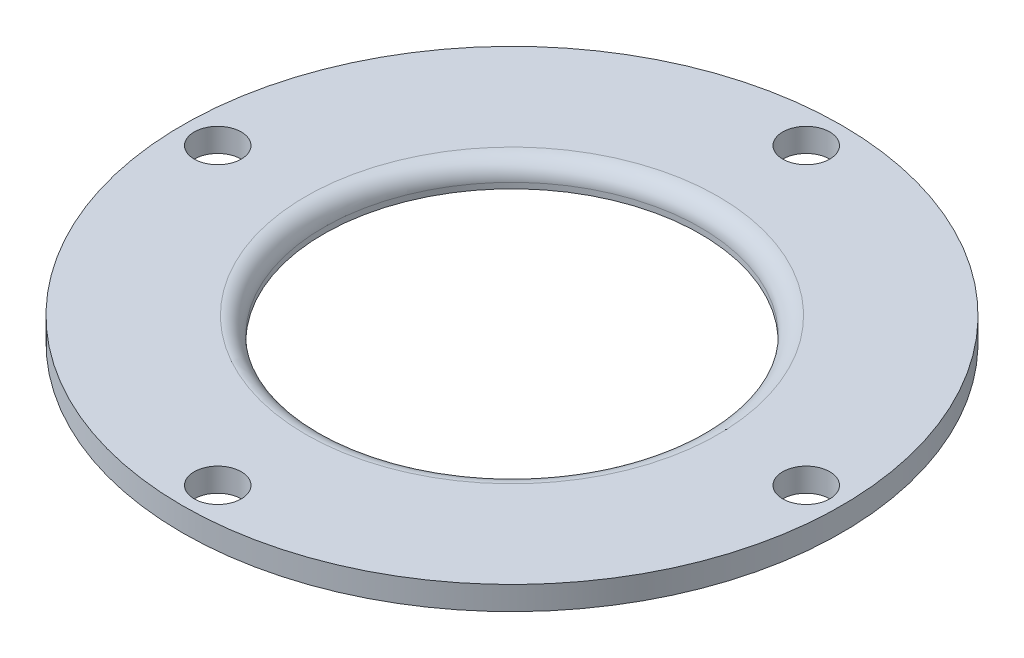
ISO-10303-21;
HEADER;
FILE_DESCRIPTION(('STEP AP214'),'2;1');
FILE_NAME('part.step','',(''),(''),'','','');
FILE_SCHEMA(('AUTOMOTIVE_DESIGN { 1 0 10303 214 1 1 1 1 }'));
ENDSEC;
DATA;
#1=APPLICATION_CONTEXT('core data for automotive mechanical design processes');
#2=APPLICATION_PROTOCOL_DEFINITION('international standard','automotive_design',2000,#1);
#3=PRODUCT_CONTEXT('',#1,'mechanical');
#4=PRODUCT('Part','Part','',(#3));
#5=PRODUCT_RELATED_PRODUCT_CATEGORY('part','',(#4));
#6=PRODUCT_DEFINITION_FORMATION('','',#4);
#7=PRODUCT_DEFINITION_CONTEXT('part definition',#1,'design');
#8=PRODUCT_DEFINITION('design','',#6,#7);
#9=PRODUCT_DEFINITION_SHAPE('','',#8);
#10=(LENGTH_UNIT() NAMED_UNIT(*) SI_UNIT(.MILLI.,.METRE.));
#11=(NAMED_UNIT(*) PLANE_ANGLE_UNIT() SI_UNIT($,.RADIAN.));
#12=(NAMED_UNIT(*) SI_UNIT($,.STERADIAN.) SOLID_ANGLE_UNIT());
#13=UNCERTAINTY_MEASURE_WITH_UNIT(LENGTH_MEASURE(1.E-05),#10,'distance_accuracy_value','');
#14=(GEOMETRIC_REPRESENTATION_CONTEXT(3) GLOBAL_UNCERTAINTY_ASSIGNED_CONTEXT((#13)) GLOBAL_UNIT_ASSIGNED_CONTEXT((#10,
#11,#12)) REPRESENTATION_CONTEXT('',''));
#15=CARTESIAN_POINT('',(0.,0.,0.));
#16=DIRECTION('',(0.,0.,1.));
#17=DIRECTION('',(1.,0.,0.));
#18=AXIS2_PLACEMENT_3D('',#15,#16,#17);
#19=CARTESIAN_POINT('',(0.,6.35,0.));
#20=DIRECTION('',(0.,-1.,0.));
#21=DIRECTION('',(0.,0.,-1.));
#22=AXIS2_PLACEMENT_3D('',#19,#20,#21);
#23=CYLINDRICAL_SURFACE('',#22,88.9);
#24=CARTESIAN_POINT('',(0.,6.35,0.));
#25=DIRECTION('',(0.,1.,0.));
#26=DIRECTION('',(0.,0.,1.));
#27=AXIS2_PLACEMENT_3D('',#24,#25,#26);
#28=CIRCLE('',#27,88.9);
#29=CARTESIAN_POINT('',(0.,6.35,88.9));
#30=VERTEX_POINT('',#29);
#31=EDGE_CURVE('E41',#30,#30,#28,.T.);
#32=ORIENTED_EDGE('',*,*,#31,.F.);
#33=EDGE_LOOP('',(#32));
#34=FACE_BOUND('',#33,.T.);
#35=CARTESIAN_POINT('',(0.,0.,0.));
#36=DIRECTION('',(0.,1.,0.));
#37=DIRECTION('',(0.,0.,1.));
#38=AXIS2_PLACEMENT_3D('',#35,#36,#37);
#39=CIRCLE('',#38,88.9);
#40=CARTESIAN_POINT('',(0.,0.,88.9));
#41=VERTEX_POINT('',#40);
#42=EDGE_CURVE('E45',#41,#41,#39,.T.);
#43=ORIENTED_EDGE('',*,*,#42,.T.);
#44=EDGE_LOOP('',(#43));
#45=FACE_BOUND('',#44,.T.);
#46=ADVANCED_FACE('F30',(#34,#45),#23,.T.);
#47=CARTESIAN_POINT('',(0.,6.35,0.));
#48=DIRECTION('',(0.,1.,0.));
#49=DIRECTION('',(0.,0.,1.));
#50=AXIS2_PLACEMENT_3D('',#47,#48,#49);
#51=PLANE('',#50);
#52=CARTESIAN_POINT('',(-2.77136331270674E-13,6.35,-79.375));
#53=DIRECTION('',(0.,-1.,0.));
#54=DIRECTION('',(0.,0.,-1.));
#55=AXIS2_PLACEMENT_3D('',#52,#53,#54);
#56=CIRCLE('',#55,6.34999999999999);
#57=CARTESIAN_POINT('',(-2.77136331270674E-13,6.35,-85.725));
#58=VERTEX_POINT('',#57);
#59=EDGE_CURVE('E53',#58,#58,#56,.T.);
#60=ORIENTED_EDGE('',*,*,#59,.T.);
#61=EDGE_LOOP('',(#60));
#62=FACE_BOUND('',#61,.T.);
#63=CARTESIAN_POINT('',(79.375,6.35,0.));
#64=DIRECTION('',(0.,-1.,0.));
#65=DIRECTION('',(0.,0.,-1.));
#66=AXIS2_PLACEMENT_3D('',#63,#64,#65);
#67=CIRCLE('',#66,6.35);
#68=CARTESIAN_POINT('',(79.375,6.35,-6.35));
#69=VERTEX_POINT('',#68);
#70=EDGE_CURVE('E69',#69,#69,#67,.T.);
#71=ORIENTED_EDGE('',*,*,#70,.T.);
#72=EDGE_LOOP('',(#71));
#73=FACE_BOUND('',#72,.T.);
#74=CARTESIAN_POINT('',(-79.375,6.35,5.54272662541347E-13));
#75=DIRECTION('',(0.,-1.,0.));
#76=DIRECTION('',(0.,0.,-1.));
#77=AXIS2_PLACEMENT_3D('',#74,#75,#76);
#78=CIRCLE('',#77,6.35);
#79=CARTESIAN_POINT('',(-79.375,6.35,-6.34999999999944));
#80=VERTEX_POINT('',#79);
#81=EDGE_CURVE('E63',#80,#80,#78,.T.);
#82=ORIENTED_EDGE('',*,*,#81,.T.);
#83=EDGE_LOOP('',(#82));
#84=FACE_BOUND('',#83,.T.);
#85=CARTESIAN_POINT('',(8.31408993812021E-13,6.35,79.375));
#86=DIRECTION('',(0.,-1.,0.));
#87=DIRECTION('',(0.,0.,-1.));
#88=AXIS2_PLACEMENT_3D('',#85,#86,#87);
#89=CIRCLE('',#88,6.34999999999999);
#90=CARTESIAN_POINT('',(8.31408993812021E-13,6.35,73.025));
#91=VERTEX_POINT('',#90);
#92=EDGE_CURVE('E57',#91,#91,#89,.T.);
#93=ORIENTED_EDGE('',*,*,#92,.T.);
#94=EDGE_LOOP('',(#93));
#95=FACE_BOUND('',#94,.T.);
#96=CARTESIAN_POINT('',(0.,6.35,0.));
#97=DIRECTION('',(0.,1.,0.));
#98=DIRECTION('',(0.,0.,1.));
#99=AXIS2_PLACEMENT_3D('',#96,#97,#98);
#100=CIRCLE('',#99,55.626);
#101=CARTESIAN_POINT('',(0.,6.35,55.626));
#102=VERTEX_POINT('',#101);
#103=EDGE_CURVE('E10',#102,#102,#100,.F.);
#104=ORIENTED_EDGE('',*,*,#103,.T.);
#105=EDGE_LOOP('',(#104));
#106=FACE_BOUND('',#105,.T.);
#107=ORIENTED_EDGE('',*,*,#31,.T.);
#108=EDGE_LOOP('',(#107));
#109=FACE_BOUND('',#108,.T.);
#110=ADVANCED_FACE('F78',(#62,#73,#84,#95,#106,#109),#51,.T.);
#111=CARTESIAN_POINT('',(0.,0.,0.));
#112=DIRECTION('',(0.,1.,0.));
#113=DIRECTION('',(0.,0.,1.));
#114=AXIS2_PLACEMENT_3D('',#111,#112,#113);
#115=PLANE('',#114);
#116=CARTESIAN_POINT('',(-2.77136331270674E-13,0.,-79.375));
#117=DIRECTION('',(0.,-1.,0.));
#118=DIRECTION('',(0.,0.,-1.));
#119=AXIS2_PLACEMENT_3D('',#116,#117,#118);
#120=CIRCLE('',#119,6.34999999999999);
#121=CARTESIAN_POINT('',(-2.77136331270674E-13,0.,-85.725));
#122=VERTEX_POINT('',#121);
#123=EDGE_CURVE('E72',#122,#122,#120,.T.);
#124=ORIENTED_EDGE('',*,*,#123,.F.);
#125=EDGE_LOOP('',(#124));
#126=FACE_BOUND('',#125,.T.);
#127=CARTESIAN_POINT('',(79.375,0.,0.));
#128=DIRECTION('',(0.,-1.,0.));
#129=DIRECTION('',(0.,0.,-1.));
#130=AXIS2_PLACEMENT_3D('',#127,#128,#129);
#131=CIRCLE('',#130,6.35);
#132=CARTESIAN_POINT('',(79.375,0.,-6.35));
#133=VERTEX_POINT('',#132);
#134=EDGE_CURVE('E66',#133,#133,#131,.T.);
#135=ORIENTED_EDGE('',*,*,#134,.F.);
#136=EDGE_LOOP('',(#135));
#137=FACE_BOUND('',#136,.T.);
#138=CARTESIAN_POINT('',(-79.375,0.,5.54272662541347E-13));
#139=DIRECTION('',(0.,-1.,0.));
#140=DIRECTION('',(0.,0.,-1.));
#141=AXIS2_PLACEMENT_3D('',#138,#139,#140);
#142=CIRCLE('',#141,6.35);
#143=CARTESIAN_POINT('',(-79.375,0.,-6.34999999999944));
#144=VERTEX_POINT('',#143);
#145=EDGE_CURVE('E60',#144,#144,#142,.T.);
#146=ORIENTED_EDGE('',*,*,#145,.F.);
#147=EDGE_LOOP('',(#146));
#148=FACE_BOUND('',#147,.T.);
#149=CARTESIAN_POINT('',(8.31408993812021E-13,0.,79.375));
#150=DIRECTION('',(0.,-1.,0.));
#151=DIRECTION('',(0.,0.,-1.));
#152=AXIS2_PLACEMENT_3D('',#149,#150,#151);
#153=CIRCLE('',#152,6.34999999999999);
#154=CARTESIAN_POINT('',(8.31408993812021E-13,0.,73.025));
#155=VERTEX_POINT('',#154);
#156=EDGE_CURVE('E54',#155,#155,#153,.T.);
#157=ORIENTED_EDGE('',*,*,#156,.F.);
#158=EDGE_LOOP('',(#157));
#159=FACE_BOUND('',#158,.T.);
#160=CARTESIAN_POINT('',(0.,0.,0.));
#161=DIRECTION('',(0.,1.,0.));
#162=DIRECTION('',(0.,0.,1.));
#163=AXIS2_PLACEMENT_3D('',#160,#161,#162);
#164=CIRCLE('',#163,50.8);
#165=CARTESIAN_POINT('',(0.,0.,50.8));
#166=VERTEX_POINT('',#165);
#167=EDGE_CURVE('E49',#166,#166,#164,.T.);
#168=ORIENTED_EDGE('',*,*,#167,.T.);
#169=EDGE_LOOP('',(#168));
#170=FACE_BOUND('',#169,.T.);
#171=ORIENTED_EDGE('',*,*,#42,.F.);
#172=EDGE_LOOP('',(#171));
#173=FACE_BOUND('',#172,.T.);
#174=ADVANCED_FACE('F88',(#126,#137,#148,#159,#170,#173),#115,.F.);
#175=CARTESIAN_POINT('',(0.,0.,0.));
#176=DIRECTION('',(0.,1.,0.));
#177=DIRECTION('',(0.,0.,1.));
#178=AXIS2_PLACEMENT_3D('',#175,#176,#177);
#179=CYLINDRICAL_SURFACE('',#178,50.8);
#180=CARTESIAN_POINT('',(0.,1.524,0.));
#181=DIRECTION('',(0.,1.,0.));
#182=DIRECTION('',(0.,0.,1.));
#183=AXIS2_PLACEMENT_3D('',#180,#181,#182);
#184=CIRCLE('',#183,50.8);
#185=CARTESIAN_POINT('',(0.,1.524,50.8));
#186=VERTEX_POINT('',#185);
#187=EDGE_CURVE('E37',#186,#186,#184,.T.);
#188=ORIENTED_EDGE('',*,*,#187,.T.);
#189=EDGE_LOOP('',(#188));
#190=FACE_BOUND('',#189,.T.);
#191=ORIENTED_EDGE('',*,*,#167,.F.);
#192=EDGE_LOOP('',(#191));
#193=FACE_BOUND('',#192,.T.);
#194=ADVANCED_FACE('F91',(#190,#193),#179,.F.);
#195=CARTESIAN_POINT('',(0.,1.524,0.));
#196=DIRECTION('',(0.,1.,0.));
#197=DIRECTION('',(0.,0.,1.));
#198=AXIS2_PLACEMENT_3D('',#195,#196,#197);
#199=TOROIDAL_SURFACE('',#198,55.626,4.826);
#200=ORIENTED_EDGE('',*,*,#103,.F.);
#201=EDGE_LOOP('',(#200));
#202=FACE_BOUND('',#201,.T.);
#203=ORIENTED_EDGE('',*,*,#187,.F.);
#204=EDGE_LOOP('',(#203));
#205=FACE_BOUND('',#204,.T.);
#206=ADVANCED_FACE('F32',(#202,#205),#199,.T.);
#207=CARTESIAN_POINT('',(8.31408993812021E-13,6.35,79.375));
#208=DIRECTION('',(0.,-1.,0.));
#209=DIRECTION('',(0.,0.,-1.));
#210=AXIS2_PLACEMENT_3D('',#207,#208,#209);
#211=CYLINDRICAL_SURFACE('',#210,6.34999999999999);
#212=ORIENTED_EDGE('',*,*,#92,.F.);
#213=EDGE_LOOP('',(#212));
#214=FACE_BOUND('',#213,.T.);
#215=ORIENTED_EDGE('',*,*,#156,.T.);
#216=EDGE_LOOP('',(#215));
#217=FACE_BOUND('',#216,.T.);
#218=ADVANCED_FACE('F113',(#214,#217),#211,.F.);
#219=CARTESIAN_POINT('',(-79.375,6.35,5.54272662541347E-13));
#220=DIRECTION('',(0.,-1.,0.));
#221=DIRECTION('',(0.,0.,-1.));
#222=AXIS2_PLACEMENT_3D('',#219,#220,#221);
#223=CYLINDRICAL_SURFACE('',#222,6.35);
#224=ORIENTED_EDGE('',*,*,#81,.F.);
#225=EDGE_LOOP('',(#224));
#226=FACE_BOUND('',#225,.T.);
#227=ORIENTED_EDGE('',*,*,#145,.T.);
#228=EDGE_LOOP('',(#227));
#229=FACE_BOUND('',#228,.T.);
#230=ADVANCED_FACE('F116',(#226,#229),#223,.F.);
#231=CARTESIAN_POINT('',(79.375,6.35,0.));
#232=DIRECTION('',(0.,-1.,0.));
#233=DIRECTION('',(0.,0.,-1.));
#234=AXIS2_PLACEMENT_3D('',#231,#232,#233);
#235=CYLINDRICAL_SURFACE('',#234,6.35);
#236=ORIENTED_EDGE('',*,*,#70,.F.);
#237=EDGE_LOOP('',(#236));
#238=FACE_BOUND('',#237,.T.);
#239=ORIENTED_EDGE('',*,*,#134,.T.);
#240=EDGE_LOOP('',(#239));
#241=FACE_BOUND('',#240,.T.);
#242=ADVANCED_FACE('F84',(#238,#241),#235,.F.);
#243=CARTESIAN_POINT('',(-2.77136331270674E-13,6.35,-79.375));
#244=DIRECTION('',(0.,-1.,0.));
#245=DIRECTION('',(0.,0.,-1.));
#246=AXIS2_PLACEMENT_3D('',#243,#244,#245);
#247=CYLINDRICAL_SURFACE('',#246,6.34999999999999);
#248=ORIENTED_EDGE('',*,*,#59,.F.);
#249=EDGE_LOOP('',(#248));
#250=FACE_BOUND('',#249,.T.);
#251=ORIENTED_EDGE('',*,*,#123,.T.);
#252=EDGE_LOOP('',(#251));
#253=FACE_BOUND('',#252,.T.);
#254=ADVANCED_FACE('F81',(#250,#253),#247,.F.);
#255=CLOSED_SHELL('',(#46,#110,#174,#194,#206,#218,#230,#242,#254));
#256=MANIFOLD_SOLID_BREP('B2',#255);
#257=ADVANCED_BREP_SHAPE_REPRESENTATION('',(#18,#256),#14);
#258=SHAPE_DEFINITION_REPRESENTATION(#9,#257);
ENDSEC;
END-ISO-10303-21;
